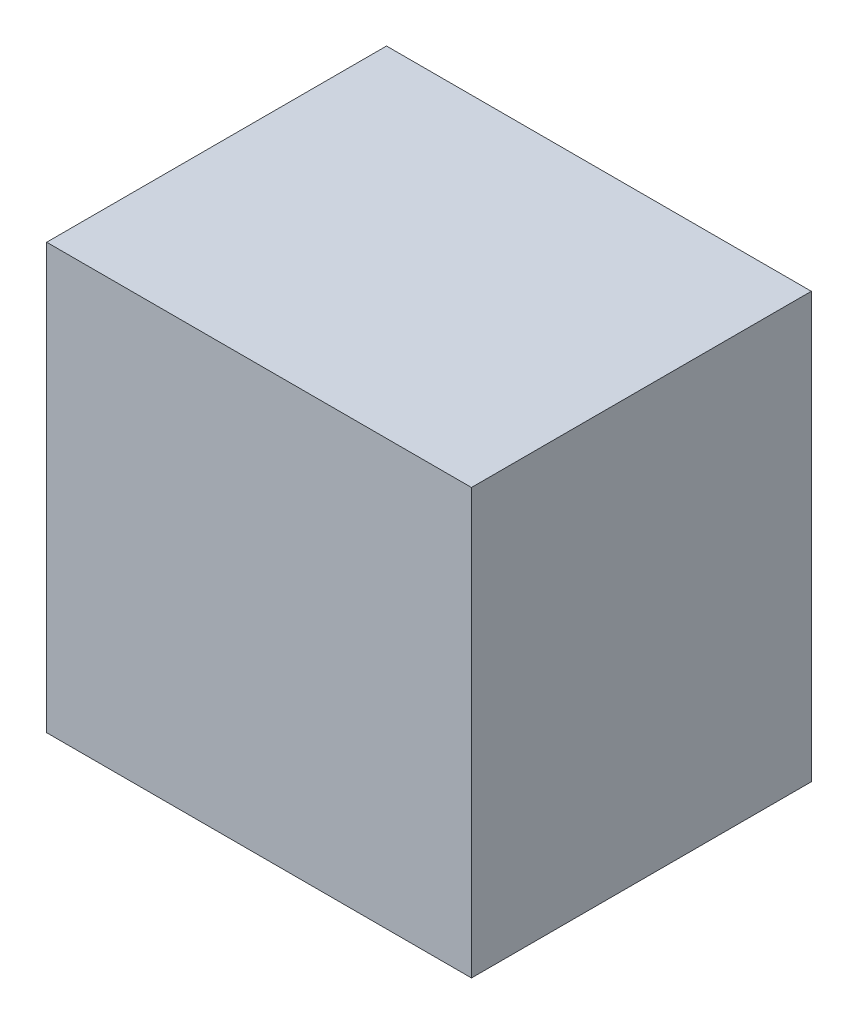
ISO-10303-21;
HEADER;
FILE_DESCRIPTION(('STEP AP214'),'2;1');
FILE_NAME('part.step','',(''),(''),'','','');
FILE_SCHEMA(('AUTOMOTIVE_DESIGN { 1 0 10303 214 1 1 1 1 }'));
ENDSEC;
DATA;
#1=APPLICATION_CONTEXT('core data for automotive mechanical design processes');
#2=APPLICATION_PROTOCOL_DEFINITION('international standard','automotive_design',2000,#1);
#3=PRODUCT_CONTEXT('',#1,'mechanical');
#4=PRODUCT('Part','Part','',(#3));
#5=PRODUCT_RELATED_PRODUCT_CATEGORY('part','',(#4));
#6=PRODUCT_DEFINITION_FORMATION('','',#4);
#7=PRODUCT_DEFINITION_CONTEXT('part definition',#1,'design');
#8=PRODUCT_DEFINITION('design','',#6,#7);
#9=PRODUCT_DEFINITION_SHAPE('','',#8);
#10=(LENGTH_UNIT() NAMED_UNIT(*) SI_UNIT(.MILLI.,.METRE.));
#11=(NAMED_UNIT(*) PLANE_ANGLE_UNIT() SI_UNIT($,.RADIAN.));
#12=(NAMED_UNIT(*) SI_UNIT($,.STERADIAN.) SOLID_ANGLE_UNIT());
#13=UNCERTAINTY_MEASURE_WITH_UNIT(LENGTH_MEASURE(1.E-05),#10,'distance_accuracy_value','');
#14=(GEOMETRIC_REPRESENTATION_CONTEXT(3) GLOBAL_UNCERTAINTY_ASSIGNED_CONTEXT((#13)) GLOBAL_UNIT_ASSIGNED_CONTEXT((#10,
#11,#12)) REPRESENTATION_CONTEXT('',''));
#15=CARTESIAN_POINT('',(0.,0.,0.));
#16=DIRECTION('',(0.,0.,1.));
#17=DIRECTION('',(1.,0.,0.));
#18=AXIS2_PLACEMENT_3D('',#15,#16,#17);
#19=CARTESIAN_POINT('',(0.,100.,0.));
#20=DIRECTION('',(1.,0.,0.));
#21=DIRECTION('',(0.,0.,-1.));
#22=AXIS2_PLACEMENT_3D('',#19,#20,#21);
#23=PLANE('',#22);
#24=DIRECTION('',(0.,0.,1.));
#25=VECTOR('',#24,1.);
#26=CARTESIAN_POINT('',(0.,0.,0.));
#27=LINE('',#26,#25);
#28=CARTESIAN_POINT('',(0.,0.,-80.));
#29=VERTEX_POINT('',#28);
#30=CARTESIAN_POINT('',(0.,0.,0.));
#31=VERTEX_POINT('',#30);
#32=EDGE_CURVE('E107',#29,#31,#27,.T.);
#33=ORIENTED_EDGE('',*,*,#32,.T.);
#34=DIRECTION('',(0.,-1.,0.));
#35=VECTOR('',#34,1.);
#36=CARTESIAN_POINT('',(0.,100.,0.));
#37=LINE('',#36,#35);
#38=CARTESIAN_POINT('',(0.,100.,0.));
#39=VERTEX_POINT('',#38);
#40=EDGE_CURVE('E11',#39,#31,#37,.T.);
#41=ORIENTED_EDGE('',*,*,#40,.F.);
#42=DIRECTION('',(0.,0.,1.));
#43=VECTOR('',#42,1.);
#44=CARTESIAN_POINT('',(0.,100.,0.));
#45=LINE('',#44,#43);
#46=CARTESIAN_POINT('',(0.,100.,-80.));
#47=VERTEX_POINT('',#46);
#48=EDGE_CURVE('E91',#47,#39,#45,.T.);
#49=ORIENTED_EDGE('',*,*,#48,.F.);
#50=DIRECTION('',(0.,-1.,0.));
#51=VECTOR('',#50,1.);
#52=CARTESIAN_POINT('',(0.,100.,-80.));
#53=LINE('',#52,#51);
#54=EDGE_CURVE('E103',#47,#29,#53,.T.);
#55=ORIENTED_EDGE('',*,*,#54,.T.);
#56=EDGE_LOOP('',(#33,#41,#49,#55));
#57=FACE_BOUND('',#56,.T.);
#58=ADVANCED_FACE('F39',(#57),#23,.F.);
#59=CARTESIAN_POINT('',(0.,100.,0.));
#60=DIRECTION('',(0.,0.,-1.));
#61=DIRECTION('',(-1.,0.,0.));
#62=AXIS2_PLACEMENT_3D('',#59,#60,#61);
#63=PLANE('',#62);
#64=DIRECTION('',(1.,0.,0.));
#65=VECTOR('',#64,1.);
#66=CARTESIAN_POINT('',(0.,0.,0.));
#67=LINE('',#66,#65);
#68=CARTESIAN_POINT('',(100.,0.,0.));
#69=VERTEX_POINT('',#68);
#70=EDGE_CURVE('E96',#31,#69,#67,.T.);
#71=ORIENTED_EDGE('',*,*,#70,.T.);
#72=DIRECTION('',(0.,-1.,0.));
#73=VECTOR('',#72,1.);
#74=CARTESIAN_POINT('',(100.,100.,0.));
#75=LINE('',#74,#73);
#76=CARTESIAN_POINT('',(100.,100.,0.));
#77=VERTEX_POINT('',#76);
#78=EDGE_CURVE('E48',#77,#69,#75,.T.);
#79=ORIENTED_EDGE('',*,*,#78,.F.);
#80=DIRECTION('',(1.,0.,0.));
#81=VECTOR('',#80,1.);
#82=CARTESIAN_POINT('',(0.,100.,0.));
#83=LINE('',#82,#81);
#84=EDGE_CURVE('E86',#39,#77,#83,.T.);
#85=ORIENTED_EDGE('',*,*,#84,.F.);
#86=ORIENTED_EDGE('',*,*,#40,.T.);
#87=EDGE_LOOP('',(#71,#79,#85,#86));
#88=FACE_BOUND('',#87,.T.);
#89=ADVANCED_FACE('F95',(#88),#63,.F.);
#90=CARTESIAN_POINT('',(100.,100.,0.));
#91=DIRECTION('',(-1.,0.,0.));
#92=DIRECTION('',(0.,0.,1.));
#93=AXIS2_PLACEMENT_3D('',#90,#91,#92);
#94=PLANE('',#93);
#95=DIRECTION('',(0.,0.,-1.));
#96=VECTOR('',#95,1.);
#97=CARTESIAN_POINT('',(100.,0.,0.));
#98=LINE('',#97,#96);
#99=CARTESIAN_POINT('',(100.,0.,-80.));
#100=VERTEX_POINT('',#99);
#101=EDGE_CURVE('E73',#69,#100,#98,.T.);
#102=ORIENTED_EDGE('',*,*,#101,.T.);
#103=DIRECTION('',(0.,-1.,0.));
#104=VECTOR('',#103,1.);
#105=CARTESIAN_POINT('',(100.,100.,-80.));
#106=LINE('',#105,#104);
#107=CARTESIAN_POINT('',(100.,100.,-80.));
#108=VERTEX_POINT('',#107);
#109=EDGE_CURVE('E98',#108,#100,#106,.T.);
#110=ORIENTED_EDGE('',*,*,#109,.F.);
#111=DIRECTION('',(0.,0.,-1.));
#112=VECTOR('',#111,1.);
#113=CARTESIAN_POINT('',(100.,100.,0.));
#114=LINE('',#113,#112);
#115=EDGE_CURVE('E89',#77,#108,#114,.T.);
#116=ORIENTED_EDGE('',*,*,#115,.F.);
#117=ORIENTED_EDGE('',*,*,#78,.T.);
#118=EDGE_LOOP('',(#102,#110,#116,#117));
#119=FACE_BOUND('',#118,.T.);
#120=ADVANCED_FACE('F99',(#119),#94,.F.);
#121=CARTESIAN_POINT('',(0.,100.,-80.));
#122=DIRECTION('',(0.,0.,1.));
#123=DIRECTION('',(1.,0.,0.));
#124=AXIS2_PLACEMENT_3D('',#121,#122,#123);
#125=PLANE('',#124);
#126=DIRECTION('',(-1.,0.,0.));
#127=VECTOR('',#126,1.);
#128=CARTESIAN_POINT('',(0.,0.,-80.));
#129=LINE('',#128,#127);
#130=EDGE_CURVE('E79',#100,#29,#129,.T.);
#131=ORIENTED_EDGE('',*,*,#130,.T.);
#132=ORIENTED_EDGE('',*,*,#54,.F.);
#133=DIRECTION('',(-1.,0.,0.));
#134=VECTOR('',#133,1.);
#135=CARTESIAN_POINT('',(0.,100.,-80.));
#136=LINE('',#135,#134);
#137=EDGE_CURVE('E56',#108,#47,#136,.T.);
#138=ORIENTED_EDGE('',*,*,#137,.F.);
#139=ORIENTED_EDGE('',*,*,#109,.T.);
#140=EDGE_LOOP('',(#131,#132,#138,#139));
#141=FACE_BOUND('',#140,.T.);
#142=ADVANCED_FACE('F120',(#141),#125,.F.);
#143=CARTESIAN_POINT('',(0.,100.,0.));
#144=DIRECTION('',(0.,-1.,0.));
#145=DIRECTION('',(0.,0.,-1.));
#146=AXIS2_PLACEMENT_3D('',#143,#144,#145);
#147=PLANE('',#146);
#148=ORIENTED_EDGE('',*,*,#48,.T.);
#149=ORIENTED_EDGE('',*,*,#84,.T.);
#150=ORIENTED_EDGE('',*,*,#115,.T.);
#151=ORIENTED_EDGE('',*,*,#137,.T.);
#152=EDGE_LOOP('',(#148,#149,#150,#151));
#153=FACE_BOUND('',#152,.T.);
#154=ADVANCED_FACE('F87',(#153),#147,.F.);
#155=CARTESIAN_POINT('',(0.,0.,0.));
#156=DIRECTION('',(0.,-1.,0.));
#157=DIRECTION('',(0.,0.,-1.));
#158=AXIS2_PLACEMENT_3D('',#155,#156,#157);
#159=PLANE('',#158);
#160=ORIENTED_EDGE('',*,*,#32,.F.);
#161=ORIENTED_EDGE('',*,*,#130,.F.);
#162=ORIENTED_EDGE('',*,*,#101,.F.);
#163=ORIENTED_EDGE('',*,*,#70,.F.);
#164=EDGE_LOOP('',(#160,#161,#162,#163));
#165=FACE_BOUND('',#164,.T.);
#166=ADVANCED_FACE('F123',(#165),#159,.T.);
#167=CLOSED_SHELL('',(#58,#89,#120,#142,#154,#166));
#168=MANIFOLD_SOLID_BREP('B2',#167);
#169=ADVANCED_BREP_SHAPE_REPRESENTATION('',(#18,#168),#14);
#170=SHAPE_DEFINITION_REPRESENTATION(#9,#169);
ENDSEC;
END-ISO-10303-21;
